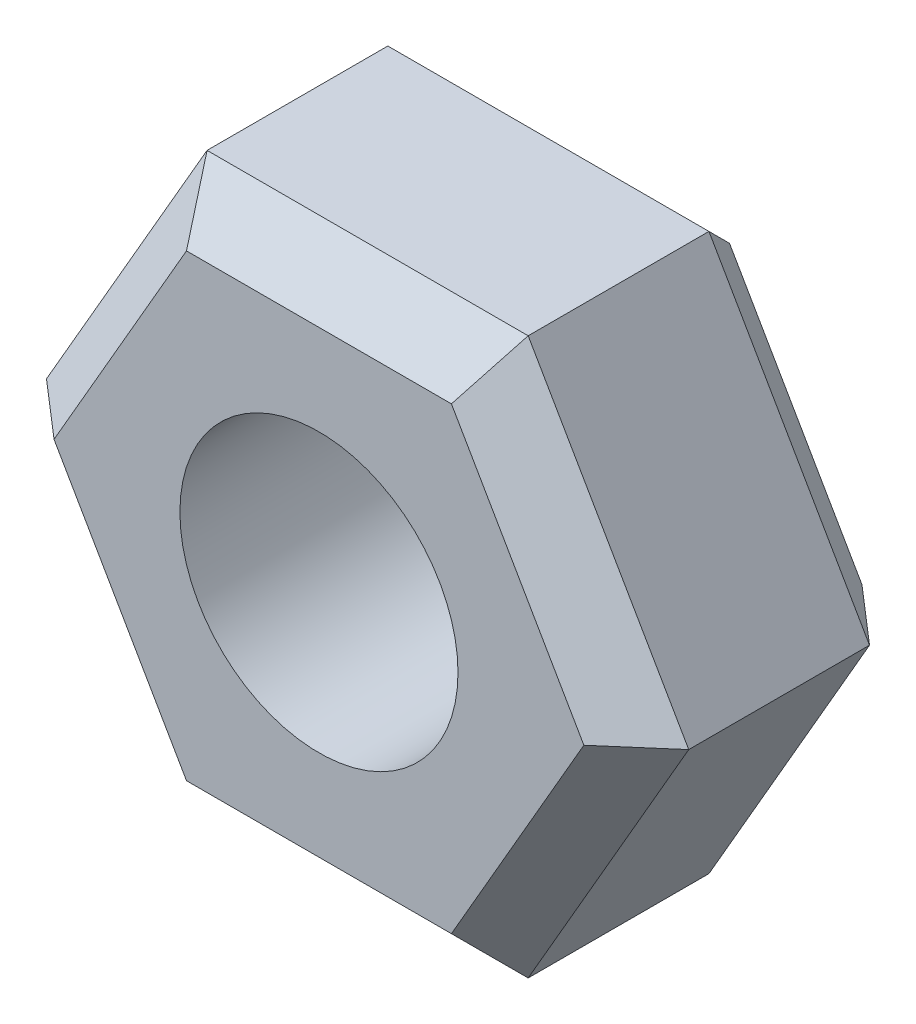
ISO-10303-21;
HEADER;
FILE_DESCRIPTION(('STEP AP214'),'2;1');
FILE_NAME('part.step','',(''),(''),'','','');
FILE_SCHEMA(('AUTOMOTIVE_DESIGN { 1 0 10303 214 1 1 1 1 }'));
ENDSEC;
DATA;
#1=APPLICATION_CONTEXT('core data for automotive mechanical design processes');
#2=APPLICATION_PROTOCOL_DEFINITION('international standard','automotive_design',2000,#1);
#3=PRODUCT_CONTEXT('',#1,'mechanical');
#4=PRODUCT('Part','Part','',(#3));
#5=PRODUCT_RELATED_PRODUCT_CATEGORY('part','',(#4));
#6=PRODUCT_DEFINITION_FORMATION('','',#4);
#7=PRODUCT_DEFINITION_CONTEXT('part definition',#1,'design');
#8=PRODUCT_DEFINITION('design','',#6,#7);
#9=PRODUCT_DEFINITION_SHAPE('','',#8);
#10=(LENGTH_UNIT() NAMED_UNIT(*) SI_UNIT(.MILLI.,.METRE.));
#11=(NAMED_UNIT(*) PLANE_ANGLE_UNIT() SI_UNIT($,.RADIAN.));
#12=(NAMED_UNIT(*) SI_UNIT($,.STERADIAN.) SOLID_ANGLE_UNIT());
#13=UNCERTAINTY_MEASURE_WITH_UNIT(LENGTH_MEASURE(1.E-05),#10,'distance_accuracy_value','');
#14=(GEOMETRIC_REPRESENTATION_CONTEXT(3) GLOBAL_UNCERTAINTY_ASSIGNED_CONTEXT((#13)) GLOBAL_UNIT_ASSIGNED_CONTEXT((#10,
#11,#12)) REPRESENTATION_CONTEXT('',''));
#15=CARTESIAN_POINT('',(0.,0.,0.));
#16=DIRECTION('',(0.,0.,1.));
#17=DIRECTION('',(1.,0.,0.));
#18=AXIS2_PLACEMENT_3D('',#15,#16,#17);
#19=CARTESIAN_POINT('',(0.,0.,2.));
#20=DIRECTION('',(0.,0.,1.));
#21=DIRECTION('',(1.,0.,0.));
#22=AXIS2_PLACEMENT_3D('',#19,#20,#21);
#23=PLANE('',#22);
#24=DIRECTION('',(0.5,0.866025403784439,0.));
#25=VECTOR('',#24,1.);
#26=CARTESIAN_POINT('',(2.00629218543395,0.175000000000002,2.));
#27=LINE('',#26,#25);
#28=CARTESIAN_POINT('',(0.952627944162882,-1.65,2.));
#29=VERTEX_POINT('',#28);
#30=CARTESIAN_POINT('',(1.90525588832576,0.,2.));
#31=VERTEX_POINT('',#30);
#32=EDGE_CURVE('E47',#29,#31,#27,.T.);
#33=ORIENTED_EDGE('',*,*,#32,.T.);
#34=DIRECTION('',(-0.5,0.866025403784439,0.));
#35=VECTOR('',#34,1.);
#36=CARTESIAN_POINT('',(0.851591647054698,1.825,2.));
#37=LINE('',#36,#35);
#38=CARTESIAN_POINT('',(0.952627944162882,1.65,2.));
#39=VERTEX_POINT('',#38);
#40=EDGE_CURVE('E11',#31,#39,#37,.T.);
#41=ORIENTED_EDGE('',*,*,#40,.T.);
#42=DIRECTION('',(-1.,0.,0.));
#43=VECTOR('',#42,1.);
#44=CARTESIAN_POINT('',(-1.15470053837925,1.65,2.));
#45=LINE('',#44,#43);
#46=CARTESIAN_POINT('',(-0.952627944162882,1.65,2.));
#47=VERTEX_POINT('',#46);
#48=EDGE_CURVE('E200',#39,#47,#45,.T.);
#49=ORIENTED_EDGE('',*,*,#48,.T.);
#50=DIRECTION('',(-0.5,-0.866025403784439,0.));
#51=VECTOR('',#50,1.);
#52=CARTESIAN_POINT('',(-2.00629218543395,-0.175000000000001,2.));
#53=LINE('',#52,#51);
#54=CARTESIAN_POINT('',(-1.90525588832576,0.,2.));
#55=VERTEX_POINT('',#54);
#56=EDGE_CURVE('E202',#47,#55,#53,.T.);
#57=ORIENTED_EDGE('',*,*,#56,.T.);
#58=DIRECTION('',(0.5,-0.866025403784439,0.));
#59=VECTOR('',#58,1.);
#60=CARTESIAN_POINT('',(-0.851591647054698,-1.825,2.));
#61=LINE('',#60,#59);
#62=CARTESIAN_POINT('',(-0.952627944162882,-1.65,2.));
#63=VERTEX_POINT('',#62);
#64=EDGE_CURVE('E204',#55,#63,#61,.T.);
#65=ORIENTED_EDGE('',*,*,#64,.T.);
#66=DIRECTION('',(1.,0.,0.));
#67=VECTOR('',#66,1.);
#68=CARTESIAN_POINT('',(1.15470053837925,-1.65,2.));
#69=LINE('',#68,#67);
#70=EDGE_CURVE('E58',#63,#29,#69,.T.);
#71=ORIENTED_EDGE('',*,*,#70,.T.);
#72=EDGE_LOOP('',(#33,#41,#49,#57,#65,#71));
#73=FACE_BOUND('',#72,.T.);
#74=CARTESIAN_POINT('',(0.,0.,2.));
#75=DIRECTION('',(0.,0.,1.));
#76=DIRECTION('',(1.,0.,0.));
#77=AXIS2_PLACEMENT_3D('',#74,#75,#76);
#78=CIRCLE('',#77,1.);
#79=CARTESIAN_POINT('',(1.,0.,2.));
#80=VERTEX_POINT('',#79);
#81=EDGE_CURVE('E254',#80,#80,#78,.T.);
#82=ORIENTED_EDGE('',*,*,#81,.F.);
#83=EDGE_LOOP('',(#82));
#84=FACE_BOUND('',#83,.T.);
#85=ADVANCED_FACE('F38',(#73,#84),#23,.T.);
#86=CARTESIAN_POINT('',(0.,0.,0.));
#87=DIRECTION('',(0.,0.,1.));
#88=DIRECTION('',(1.,0.,0.));
#89=AXIS2_PLACEMENT_3D('',#86,#87,#88);
#90=PLANE('',#89);
#91=DIRECTION('',(0.5,-0.866025403784439,0.));
#92=VECTOR('',#91,1.);
#93=CARTESIAN_POINT('',(1.42894191624432,0.825,0.));
#94=LINE('',#93,#92);
#95=CARTESIAN_POINT('',(0.952627944162882,1.65,0.));
#96=VERTEX_POINT('',#95);
#97=CARTESIAN_POINT('',(1.90525588832576,0.,0.));
#98=VERTEX_POINT('',#97);
#99=EDGE_CURVE('E171',#96,#98,#94,.T.);
#100=ORIENTED_EDGE('',*,*,#99,.T.);
#101=DIRECTION('',(-0.5,-0.866025403784439,0.));
#102=VECTOR('',#101,1.);
#103=CARTESIAN_POINT('',(1.42894191624432,-0.824999999999999,0.));
#104=LINE('',#103,#102);
#105=CARTESIAN_POINT('',(0.952627944162882,-1.65,0.));
#106=VERTEX_POINT('',#105);
#107=EDGE_CURVE('E181',#98,#106,#104,.T.);
#108=ORIENTED_EDGE('',*,*,#107,.T.);
#109=DIRECTION('',(-1.,0.,0.));
#110=VECTOR('',#109,1.);
#111=CARTESIAN_POINT('',(0.,-1.65,0.));
#112=LINE('',#111,#110);
#113=CARTESIAN_POINT('',(-0.952627944162882,-1.65,0.));
#114=VERTEX_POINT('',#113);
#115=EDGE_CURVE('E179',#106,#114,#112,.T.);
#116=ORIENTED_EDGE('',*,*,#115,.T.);
#117=DIRECTION('',(-0.5,0.866025403784439,0.));
#118=VECTOR('',#117,1.);
#119=CARTESIAN_POINT('',(-1.42894191624432,-0.824999999999999,0.));
#120=LINE('',#119,#118);
#121=CARTESIAN_POINT('',(-1.90525588832576,0.,0.));
#122=VERTEX_POINT('',#121);
#123=EDGE_CURVE('E177',#114,#122,#120,.T.);
#124=ORIENTED_EDGE('',*,*,#123,.T.);
#125=DIRECTION('',(0.5,0.866025403784439,0.));
#126=VECTOR('',#125,1.);
#127=CARTESIAN_POINT('',(-1.42894191624432,0.824999999999999,0.));
#128=LINE('',#127,#126);
#129=CARTESIAN_POINT('',(-0.952627944162882,1.65,0.));
#130=VERTEX_POINT('',#129);
#131=EDGE_CURVE('E175',#122,#130,#128,.T.);
#132=ORIENTED_EDGE('',*,*,#131,.T.);
#133=DIRECTION('',(1.,0.,0.));
#134=VECTOR('',#133,1.);
#135=CARTESIAN_POINT('',(0.,1.65,0.));
#136=LINE('',#135,#134);
#137=EDGE_CURVE('E173',#130,#96,#136,.T.);
#138=ORIENTED_EDGE('',*,*,#137,.T.);
#139=EDGE_LOOP('',(#100,#108,#116,#124,#132,#138));
#140=FACE_BOUND('',#139,.T.);
#141=CARTESIAN_POINT('',(0.,0.,0.));
#142=DIRECTION('',(0.,0.,1.));
#143=DIRECTION('',(1.,0.,0.));
#144=AXIS2_PLACEMENT_3D('',#141,#142,#143);
#145=CIRCLE('',#144,1.);
#146=CARTESIAN_POINT('',(1.,0.,0.));
#147=VERTEX_POINT('',#146);
#148=EDGE_CURVE('E224',#147,#147,#145,.T.);
#149=ORIENTED_EDGE('',*,*,#148,.T.);
#150=EDGE_LOOP('',(#149));
#151=FACE_BOUND('',#150,.T.);
#152=ADVANCED_FACE('F262',(#140,#151),#90,.F.);
#153=CARTESIAN_POINT('',(-2.3094010767585,0.,2.));
#154=DIRECTION('',(0.866025403784439,0.5,0.));
#155=DIRECTION('',(-0.5,0.866025403784439,0.));
#156=AXIS2_PLACEMENT_3D('',#153,#154,#155);
#157=PLANE('',#156);
#158=DIRECTION('',(0.,0.,-1.));
#159=VECTOR('',#158,1.);
#160=CARTESIAN_POINT('',(-2.3094010767585,0.,2.));
#161=LINE('',#160,#159);
#162=CARTESIAN_POINT('',(-2.3094010767585,0.,1.65));
#163=VERTEX_POINT('',#162);
#164=CARTESIAN_POINT('',(-2.3094010767585,0.,0.35));
#165=VERTEX_POINT('',#164);
#166=EDGE_CURVE('E247',#163,#165,#161,.T.);
#167=ORIENTED_EDGE('',*,*,#166,.T.);
#168=DIRECTION('',(0.5,-0.866025403784439,0.));
#169=VECTOR('',#168,1.);
#170=CARTESIAN_POINT('',(-2.3094010767585,0.,0.35));
#171=LINE('',#170,#169);
#172=CARTESIAN_POINT('',(-1.15470053837925,-2.,0.35));
#173=VERTEX_POINT('',#172);
#174=EDGE_CURVE('E190',#165,#173,#171,.T.);
#175=ORIENTED_EDGE('',*,*,#174,.T.);
#176=DIRECTION('',(0.,0.,-1.));
#177=VECTOR('',#176,1.);
#178=CARTESIAN_POINT('',(-1.15470053837925,-2.,2.));
#179=LINE('',#178,#177);
#180=CARTESIAN_POINT('',(-1.15470053837925,-2.,1.65));
#181=VERTEX_POINT('',#180);
#182=EDGE_CURVE('E146',#181,#173,#179,.T.);
#183=ORIENTED_EDGE('',*,*,#182,.F.);
#184=DIRECTION('',(-0.5,0.866025403784439,0.));
#185=VECTOR('',#184,1.);
#186=CARTESIAN_POINT('',(-2.3094010767585,0.,1.65));
#187=LINE('',#186,#185);
#188=EDGE_CURVE('E188',#181,#163,#187,.T.);
#189=ORIENTED_EDGE('',*,*,#188,.T.);
#190=EDGE_LOOP('',(#167,#175,#183,#189));
#191=FACE_BOUND('',#190,.T.);
#192=ADVANCED_FACE('F246',(#191),#157,.F.);
#193=CARTESIAN_POINT('',(-1.15470053837925,-2.,2.));
#194=DIRECTION('',(0.,1.,0.));
#195=DIRECTION('',(0.,0.,1.));
#196=AXIS2_PLACEMENT_3D('',#193,#194,#195);
#197=PLANE('',#196);
#198=ORIENTED_EDGE('',*,*,#182,.T.);
#199=DIRECTION('',(1.,0.,0.));
#200=VECTOR('',#199,1.);
#201=CARTESIAN_POINT('',(-1.15470053837925,-2.,0.35));
#202=LINE('',#201,#200);
#203=CARTESIAN_POINT('',(1.15470053837925,-2.,0.35));
#204=VERTEX_POINT('',#203);
#205=EDGE_CURVE('E186',#173,#204,#202,.T.);
#206=ORIENTED_EDGE('',*,*,#205,.T.);
#207=DIRECTION('',(0.,0.,-1.));
#208=VECTOR('',#207,1.);
#209=CARTESIAN_POINT('',(1.15470053837925,-2.,2.));
#210=LINE('',#209,#208);
#211=CARTESIAN_POINT('',(1.15470053837925,-2.,1.65));
#212=VERTEX_POINT('',#211);
#213=EDGE_CURVE('E161',#212,#204,#210,.T.);
#214=ORIENTED_EDGE('',*,*,#213,.F.);
#215=DIRECTION('',(-1.,0.,0.));
#216=VECTOR('',#215,1.);
#217=CARTESIAN_POINT('',(-1.15470053837925,-2.,1.65));
#218=LINE('',#217,#216);
#219=EDGE_CURVE('E184',#212,#181,#218,.T.);
#220=ORIENTED_EDGE('',*,*,#219,.T.);
#221=EDGE_LOOP('',(#198,#206,#214,#220));
#222=FACE_BOUND('',#221,.T.);
#223=ADVANCED_FACE('F294',(#222),#197,.F.);
#224=CARTESIAN_POINT('',(1.15470053837925,-2.,2.));
#225=DIRECTION('',(-0.866025403784439,0.5,0.));
#226=DIRECTION('',(-0.5,-0.866025403784439,0.));
#227=AXIS2_PLACEMENT_3D('',#224,#225,#226);
#228=PLANE('',#227);
#229=ORIENTED_EDGE('',*,*,#213,.T.);
#230=DIRECTION('',(0.5,0.866025403784439,0.));
#231=VECTOR('',#230,1.);
#232=CARTESIAN_POINT('',(1.15470053837925,-2.,0.35));
#233=LINE('',#232,#231);
#234=CARTESIAN_POINT('',(2.3094010767585,0.,0.35));
#235=VERTEX_POINT('',#234);
#236=EDGE_CURVE('E145',#204,#235,#233,.T.);
#237=ORIENTED_EDGE('',*,*,#236,.T.);
#238=DIRECTION('',(0.,0.,-1.));
#239=VECTOR('',#238,1.);
#240=CARTESIAN_POINT('',(2.3094010767585,0.,2.));
#241=LINE('',#240,#239);
#242=CARTESIAN_POINT('',(2.3094010767585,0.,1.65));
#243=VERTEX_POINT('',#242);
#244=EDGE_CURVE('E152',#243,#235,#241,.T.);
#245=ORIENTED_EDGE('',*,*,#244,.F.);
#246=DIRECTION('',(-0.5,-0.866025403784439,0.));
#247=VECTOR('',#246,1.);
#248=CARTESIAN_POINT('',(1.15470053837925,-2.,1.65));
#249=LINE('',#248,#247);
#250=EDGE_CURVE('E138',#243,#212,#249,.T.);
#251=ORIENTED_EDGE('',*,*,#250,.T.);
#252=EDGE_LOOP('',(#229,#237,#245,#251));
#253=FACE_BOUND('',#252,.T.);
#254=ADVANCED_FACE('F159',(#253),#228,.F.);
#255=CARTESIAN_POINT('',(2.3094010767585,0.,2.));
#256=DIRECTION('',(-0.866025403784439,-0.5,0.));
#257=DIRECTION('',(0.5,-0.866025403784439,0.));
#258=AXIS2_PLACEMENT_3D('',#255,#256,#257);
#259=PLANE('',#258);
#260=ORIENTED_EDGE('',*,*,#244,.T.);
#261=DIRECTION('',(-0.5,0.866025403784439,0.));
#262=VECTOR('',#261,1.);
#263=CARTESIAN_POINT('',(2.3094010767585,0.,0.35));
#264=LINE('',#263,#262);
#265=CARTESIAN_POINT('',(1.15470053837925,2.,0.35));
#266=VERTEX_POINT('',#265);
#267=EDGE_CURVE('E155',#235,#266,#264,.T.);
#268=ORIENTED_EDGE('',*,*,#267,.T.);
#269=DIRECTION('',(0.,0.,-1.));
#270=VECTOR('',#269,1.);
#271=CARTESIAN_POINT('',(1.15470053837925,2.,2.));
#272=LINE('',#271,#270);
#273=CARTESIAN_POINT('',(1.15470053837925,2.,1.65));
#274=VERTEX_POINT('',#273);
#275=EDGE_CURVE('E154',#274,#266,#272,.T.);
#276=ORIENTED_EDGE('',*,*,#275,.F.);
#277=DIRECTION('',(0.5,-0.866025403784439,0.));
#278=VECTOR('',#277,1.);
#279=CARTESIAN_POINT('',(2.3094010767585,0.,1.65));
#280=LINE('',#279,#278);
#281=EDGE_CURVE('E131',#274,#243,#280,.T.);
#282=ORIENTED_EDGE('',*,*,#281,.T.);
#283=EDGE_LOOP('',(#260,#268,#276,#282));
#284=FACE_BOUND('',#283,.T.);
#285=ADVANCED_FACE('F151',(#284),#259,.F.);
#286=CARTESIAN_POINT('',(1.15470053837925,2.,2.));
#287=DIRECTION('',(0.,-1.,0.));
#288=DIRECTION('',(1.,0.,0.));
#289=AXIS2_PLACEMENT_3D('',#286,#287,#288);
#290=PLANE('',#289);
#291=ORIENTED_EDGE('',*,*,#275,.T.);
#292=DIRECTION('',(-1.,0.,0.));
#293=VECTOR('',#292,1.);
#294=CARTESIAN_POINT('',(1.15470053837925,2.,0.35));
#295=LINE('',#294,#293);
#296=CARTESIAN_POINT('',(-1.15470053837925,2.,0.35));
#297=VERTEX_POINT('',#296);
#298=EDGE_CURVE('E156',#266,#297,#295,.T.);
#299=ORIENTED_EDGE('',*,*,#298,.T.);
#300=DIRECTION('',(0.,0.,-1.));
#301=VECTOR('',#300,1.);
#302=CARTESIAN_POINT('',(-1.15470053837925,2.,2.));
#303=LINE('',#302,#301);
#304=CARTESIAN_POINT('',(-1.15470053837925,2.,1.65));
#305=VERTEX_POINT('',#304);
#306=EDGE_CURVE('E164',#305,#297,#303,.T.);
#307=ORIENTED_EDGE('',*,*,#306,.F.);
#308=DIRECTION('',(1.,0.,0.));
#309=VECTOR('',#308,1.);
#310=CARTESIAN_POINT('',(1.15470053837925,2.,1.65));
#311=LINE('',#310,#309);
#312=EDGE_CURVE('E196',#305,#274,#311,.T.);
#313=ORIENTED_EDGE('',*,*,#312,.T.);
#314=EDGE_LOOP('',(#291,#299,#307,#313));
#315=FACE_BOUND('',#314,.T.);
#316=ADVANCED_FACE('F276',(#315),#290,.F.);
#317=CARTESIAN_POINT('',(-1.15470053837925,2.,2.));
#318=DIRECTION('',(0.866025403784439,-0.5,0.));
#319=DIRECTION('',(0.5,0.866025403784439,0.));
#320=AXIS2_PLACEMENT_3D('',#317,#318,#319);
#321=PLANE('',#320);
#322=ORIENTED_EDGE('',*,*,#306,.T.);
#323=DIRECTION('',(-0.5,-0.866025403784439,0.));
#324=VECTOR('',#323,1.);
#325=CARTESIAN_POINT('',(-1.15470053837925,2.,0.35));
#326=LINE('',#325,#324);
#327=EDGE_CURVE('E194',#297,#165,#326,.T.);
#328=ORIENTED_EDGE('',*,*,#327,.T.);
#329=ORIENTED_EDGE('',*,*,#166,.F.);
#330=DIRECTION('',(0.5,0.866025403784439,0.));
#331=VECTOR('',#330,1.);
#332=CARTESIAN_POINT('',(-1.15470053837925,2.,1.65));
#333=LINE('',#332,#331);
#334=EDGE_CURVE('E192',#163,#305,#333,.T.);
#335=ORIENTED_EDGE('',*,*,#334,.T.);
#336=EDGE_LOOP('',(#322,#328,#329,#335));
#337=FACE_BOUND('',#336,.T.);
#338=ADVANCED_FACE('F251',(#337),#321,.F.);
#339=CARTESIAN_POINT('',(0.,0.,2.));
#340=DIRECTION('',(0.,0.,-1.));
#341=DIRECTION('',(-1.,0.,0.));
#342=AXIS2_PLACEMENT_3D('',#339,#340,#341);
#343=CYLINDRICAL_SURFACE('',#342,1.);
#344=ORIENTED_EDGE('',*,*,#81,.T.);
#345=EDGE_LOOP('',(#344));
#346=FACE_BOUND('',#345,.T.);
#347=ORIENTED_EDGE('',*,*,#148,.F.);
#348=EDGE_LOOP('',(#347));
#349=FACE_BOUND('',#348,.T.);
#350=ADVANCED_FACE('F264',(#346,#349),#343,.F.);
#351=CARTESIAN_POINT('',(-1.15470053837925,2.,0.35));
#352=DIRECTION('',(0.612372435695793,-0.353553390593273,0.707106781186549));
#353=DIRECTION('',(-0.5,-0.866025403784439,0.));
#354=AXIS2_PLACEMENT_3D('',#351,#352,#353);
#355=PLANE('',#354);
#356=DIRECTION('',(-0.377964473009228,0.654653670707979,0.654653670707975));
#357=VECTOR('',#356,1.);
#358=CARTESIAN_POINT('',(-0.824786098842322,1.42857142857143,-0.221428571428571));
#359=LINE('',#358,#357);
#360=EDGE_CURVE('E218',#130,#297,#359,.T.);
#361=ORIENTED_EDGE('',*,*,#360,.F.);
#362=ORIENTED_EDGE('',*,*,#131,.F.);
#363=DIRECTION('',(-0.755928946018456,0.,0.654653670707975));
#364=VECTOR('',#363,1.);
#365=CARTESIAN_POINT('',(-1.64957219768464,0.,-0.221428571428572));
#366=LINE('',#365,#364);
#367=EDGE_CURVE('E221',#165,#122,#366,.F.);
#368=ORIENTED_EDGE('',*,*,#367,.F.);
#369=ORIENTED_EDGE('',*,*,#327,.F.);
#370=EDGE_LOOP('',(#361,#362,#368,#369));
#371=FACE_BOUND('',#370,.T.);
#372=ADVANCED_FACE('F266',(#371),#355,.F.);
#373=CARTESIAN_POINT('',(-2.3094010767585,0.,0.35));
#374=DIRECTION('',(0.612372435695793,0.353553390593273,0.70710678118655));
#375=DIRECTION('',(0.5,-0.866025403784439,0.));
#376=AXIS2_PLACEMENT_3D('',#373,#374,#375);
#377=PLANE('',#376);
#378=ORIENTED_EDGE('',*,*,#367,.T.);
#379=ORIENTED_EDGE('',*,*,#123,.F.);
#380=DIRECTION('',(-0.377964473009228,-0.654653670707979,0.654653670707975));
#381=VECTOR('',#380,1.);
#382=CARTESIAN_POINT('',(-0.824786098842321,-1.42857142857143,-0.221428571428571));
#383=LINE('',#382,#381);
#384=EDGE_CURVE('E215',#173,#114,#383,.F.);
#385=ORIENTED_EDGE('',*,*,#384,.F.);
#386=ORIENTED_EDGE('',*,*,#174,.F.);
#387=EDGE_LOOP('',(#378,#379,#385,#386));
#388=FACE_BOUND('',#387,.T.);
#389=ADVANCED_FACE('F273',(#388),#377,.F.);
#390=CARTESIAN_POINT('',(1.15470053837925,2.,0.35));
#391=DIRECTION('',(0.,-0.707106781186545,0.707106781186549));
#392=DIRECTION('',(-1.,0.,0.));
#393=AXIS2_PLACEMENT_3D('',#390,#391,#392);
#394=PLANE('',#393);
#395=ORIENTED_EDGE('',*,*,#360,.T.);
#396=ORIENTED_EDGE('',*,*,#298,.F.);
#397=DIRECTION('',(0.377964473009228,0.654653670707979,0.654653670707975));
#398=VECTOR('',#397,1.);
#399=CARTESIAN_POINT('',(0.824786098842322,1.42857142857143,-0.221428571428571));
#400=LINE('',#399,#398);
#401=EDGE_CURVE('E212',#96,#266,#400,.T.);
#402=ORIENTED_EDGE('',*,*,#401,.F.);
#403=ORIENTED_EDGE('',*,*,#137,.F.);
#404=EDGE_LOOP('',(#395,#396,#402,#403));
#405=FACE_BOUND('',#404,.T.);
#406=ADVANCED_FACE('F311',(#405),#394,.F.);
#407=CARTESIAN_POINT('',(-1.15470053837925,-2.,0.35));
#408=DIRECTION('',(0.,0.707106781186545,0.707106781186549));
#409=DIRECTION('',(1.,0.,0.));
#410=AXIS2_PLACEMENT_3D('',#407,#408,#409);
#411=PLANE('',#410);
#412=ORIENTED_EDGE('',*,*,#384,.T.);
#413=ORIENTED_EDGE('',*,*,#115,.F.);
#414=DIRECTION('',(0.377964473009228,-0.654653670707979,0.654653670707975));
#415=VECTOR('',#414,1.);
#416=CARTESIAN_POINT('',(0.824786098842322,-1.42857142857143,-0.221428571428571));
#417=LINE('',#416,#415);
#418=EDGE_CURVE('E210',#204,#106,#417,.F.);
#419=ORIENTED_EDGE('',*,*,#418,.F.);
#420=ORIENTED_EDGE('',*,*,#205,.F.);
#421=EDGE_LOOP('',(#412,#413,#419,#420));
#422=FACE_BOUND('',#421,.T.);
#423=ADVANCED_FACE('F307',(#422),#411,.F.);
#424=CARTESIAN_POINT('',(2.3094010767585,0.,0.35));
#425=DIRECTION('',(-0.612372435695793,-0.353553390593273,0.707106781186549));
#426=DIRECTION('',(-0.5,0.866025403784439,0.));
#427=AXIS2_PLACEMENT_3D('',#424,#425,#426);
#428=PLANE('',#427);
#429=ORIENTED_EDGE('',*,*,#401,.T.);
#430=ORIENTED_EDGE('',*,*,#267,.F.);
#431=DIRECTION('',(-0.755928946018456,0.,-0.654653670707975));
#432=VECTOR('',#431,1.);
#433=CARTESIAN_POINT('',(2.3094010767585,0.,0.35));
#434=LINE('',#433,#432);
#435=EDGE_CURVE('E208',#98,#235,#434,.F.);
#436=ORIENTED_EDGE('',*,*,#435,.F.);
#437=ORIENTED_EDGE('',*,*,#99,.F.);
#438=EDGE_LOOP('',(#429,#430,#436,#437));
#439=FACE_BOUND('',#438,.T.);
#440=ADVANCED_FACE('F303',(#439),#428,.F.);
#441=CARTESIAN_POINT('',(1.15470053837925,-2.,0.35));
#442=DIRECTION('',(-0.612372435695793,0.353553390593273,0.707106781186549));
#443=DIRECTION('',(0.5,0.866025403784439,0.));
#444=AXIS2_PLACEMENT_3D('',#441,#442,#443);
#445=PLANE('',#444);
#446=ORIENTED_EDGE('',*,*,#418,.T.);
#447=ORIENTED_EDGE('',*,*,#107,.F.);
#448=ORIENTED_EDGE('',*,*,#435,.T.);
#449=ORIENTED_EDGE('',*,*,#236,.F.);
#450=EDGE_LOOP('',(#446,#447,#448,#449));
#451=FACE_BOUND('',#450,.T.);
#452=ADVANCED_FACE('F300',(#451),#445,.F.);
#453=CARTESIAN_POINT('',(-1.42894191624432,-0.825,2.));
#454=DIRECTION('',(-0.612372435695796,-0.353553390593275,0.707106781186546));
#455=DIRECTION('',(-0.5,0.866025403784439,0.));
#456=AXIS2_PLACEMENT_3D('',#453,#454,#455);
#457=PLANE('',#456);
#458=DIRECTION('',(0.755928946018453,0.,0.654653670707979));
#459=VECTOR('',#458,1.);
#460=CARTESIAN_POINT('',(-1.6330764757078,0.,2.23571428571429));
#461=LINE('',#460,#459);
#462=EDGE_CURVE('E228',#163,#55,#461,.T.);
#463=ORIENTED_EDGE('',*,*,#462,.F.);
#464=ORIENTED_EDGE('',*,*,#188,.F.);
#465=DIRECTION('',(0.377964473009227,0.654653670707976,0.654653670707979));
#466=VECTOR('',#465,1.);
#467=CARTESIAN_POINT('',(-0.8165382378539,-1.41428571428572,2.23571428571429));
#468=LINE('',#467,#466);
#469=EDGE_CURVE('E42',#63,#181,#468,.F.);
#470=ORIENTED_EDGE('',*,*,#469,.F.);
#471=ORIENTED_EDGE('',*,*,#64,.F.);
#472=EDGE_LOOP('',(#463,#464,#470,#471));
#473=FACE_BOUND('',#472,.T.);
#474=ADVANCED_FACE('F40',(#473),#457,.T.);
#475=CARTESIAN_POINT('',(0.,-1.65,2.));
#476=DIRECTION('',(0.,-0.707106781186549,0.707106781186546));
#477=DIRECTION('',(-1.,0.,0.));
#478=AXIS2_PLACEMENT_3D('',#475,#476,#477);
#479=PLANE('',#478);
#480=ORIENTED_EDGE('',*,*,#469,.T.);
#481=ORIENTED_EDGE('',*,*,#219,.F.);
#482=DIRECTION('',(-0.377964473009227,0.654653670707976,0.654653670707979));
#483=VECTOR('',#482,1.);
#484=CARTESIAN_POINT('',(0.816538237853899,-1.41428571428572,2.23571428571429));
#485=LINE('',#484,#483);
#486=EDGE_CURVE('E140',#29,#212,#485,.F.);
#487=ORIENTED_EDGE('',*,*,#486,.F.);
#488=ORIENTED_EDGE('',*,*,#70,.F.);
#489=EDGE_LOOP('',(#480,#481,#487,#488));
#490=FACE_BOUND('',#489,.T.);
#491=ADVANCED_FACE('F238',(#490),#479,.T.);
#492=CARTESIAN_POINT('',(-1.42894191624432,0.824999999999999,2.));
#493=DIRECTION('',(-0.612372435695796,0.353553390593274,0.707106781186546));
#494=DIRECTION('',(0.5,0.866025403784439,0.));
#495=AXIS2_PLACEMENT_3D('',#492,#493,#494);
#496=PLANE('',#495);
#497=ORIENTED_EDGE('',*,*,#462,.T.);
#498=ORIENTED_EDGE('',*,*,#56,.F.);
#499=DIRECTION('',(0.377964473009227,-0.654653670707975,0.654653670707979));
#500=VECTOR('',#499,1.);
#501=CARTESIAN_POINT('',(-0.8165382378539,1.41428571428571,2.23571428571429));
#502=LINE('',#501,#500);
#503=EDGE_CURVE('E134',#305,#47,#502,.T.);
#504=ORIENTED_EDGE('',*,*,#503,.F.);
#505=ORIENTED_EDGE('',*,*,#334,.F.);
#506=EDGE_LOOP('',(#497,#498,#504,#505));
#507=FACE_BOUND('',#506,.T.);
#508=ADVANCED_FACE('F327',(#507),#496,.T.);
#509=CARTESIAN_POINT('',(1.42894191624432,-0.824999999999999,2.));
#510=DIRECTION('',(0.612372435695796,-0.353553390593274,0.707106781186546));
#511=DIRECTION('',(-0.5,-0.866025403784439,0.));
#512=AXIS2_PLACEMENT_3D('',#509,#510,#511);
#513=PLANE('',#512);
#514=ORIENTED_EDGE('',*,*,#486,.T.);
#515=ORIENTED_EDGE('',*,*,#250,.F.);
#516=DIRECTION('',(-0.755928946018453,0.,0.654653670707979));
#517=VECTOR('',#516,1.);
#518=CARTESIAN_POINT('',(1.6330764757078,0.,2.23571428571429));
#519=LINE('',#518,#517);
#520=EDGE_CURVE('E127',#31,#243,#519,.F.);
#521=ORIENTED_EDGE('',*,*,#520,.F.);
#522=ORIENTED_EDGE('',*,*,#32,.F.);
#523=EDGE_LOOP('',(#514,#515,#521,#522));
#524=FACE_BOUND('',#523,.T.);
#525=ADVANCED_FACE('F139',(#524),#513,.T.);
#526=CARTESIAN_POINT('',(0.,1.65,2.));
#527=DIRECTION('',(0.,0.707106781186549,0.707106781186546));
#528=DIRECTION('',(1.,0.,0.));
#529=AXIS2_PLACEMENT_3D('',#526,#527,#528);
#530=PLANE('',#529);
#531=ORIENTED_EDGE('',*,*,#503,.T.);
#532=ORIENTED_EDGE('',*,*,#48,.F.);
#533=DIRECTION('',(0.377964473009226,0.654653670707976,-0.654653670707979));
#534=VECTOR('',#533,1.);
#535=CARTESIAN_POINT('',(0.8165382378539,1.41428571428572,2.23571428571429));
#536=LINE('',#535,#534);
#537=EDGE_CURVE('E135',#274,#39,#536,.F.);
#538=ORIENTED_EDGE('',*,*,#537,.F.);
#539=ORIENTED_EDGE('',*,*,#312,.F.);
#540=EDGE_LOOP('',(#531,#532,#538,#539));
#541=FACE_BOUND('',#540,.T.);
#542=ADVANCED_FACE('F321',(#541),#530,.T.);
#543=CARTESIAN_POINT('',(1.42894191624432,0.825,2.));
#544=DIRECTION('',(0.612372435695796,0.353553390593275,0.707106781186546));
#545=DIRECTION('',(0.5,-0.866025403784439,0.));
#546=AXIS2_PLACEMENT_3D('',#543,#544,#545);
#547=PLANE('',#546);
#548=ORIENTED_EDGE('',*,*,#520,.T.);
#549=ORIENTED_EDGE('',*,*,#281,.F.);
#550=ORIENTED_EDGE('',*,*,#537,.T.);
#551=ORIENTED_EDGE('',*,*,#40,.F.);
#552=EDGE_LOOP('',(#548,#549,#550,#551));
#553=FACE_BOUND('',#552,.T.);
#554=ADVANCED_FACE('F129',(#553),#547,.T.);
#555=CLOSED_SHELL('',(#85,#152,#192,#223,#254,#285,#316,#338,#350,#372,#389,#406,#423,#440,#452,
#474,#491,#508,#525,#542,#554));
#556=MANIFOLD_SOLID_BREP('B2',#555);
#557=ADVANCED_BREP_SHAPE_REPRESENTATION('',(#18,#556),#14);
#558=SHAPE_DEFINITION_REPRESENTATION(#9,#557);
ENDSEC;
END-ISO-10303-21;
